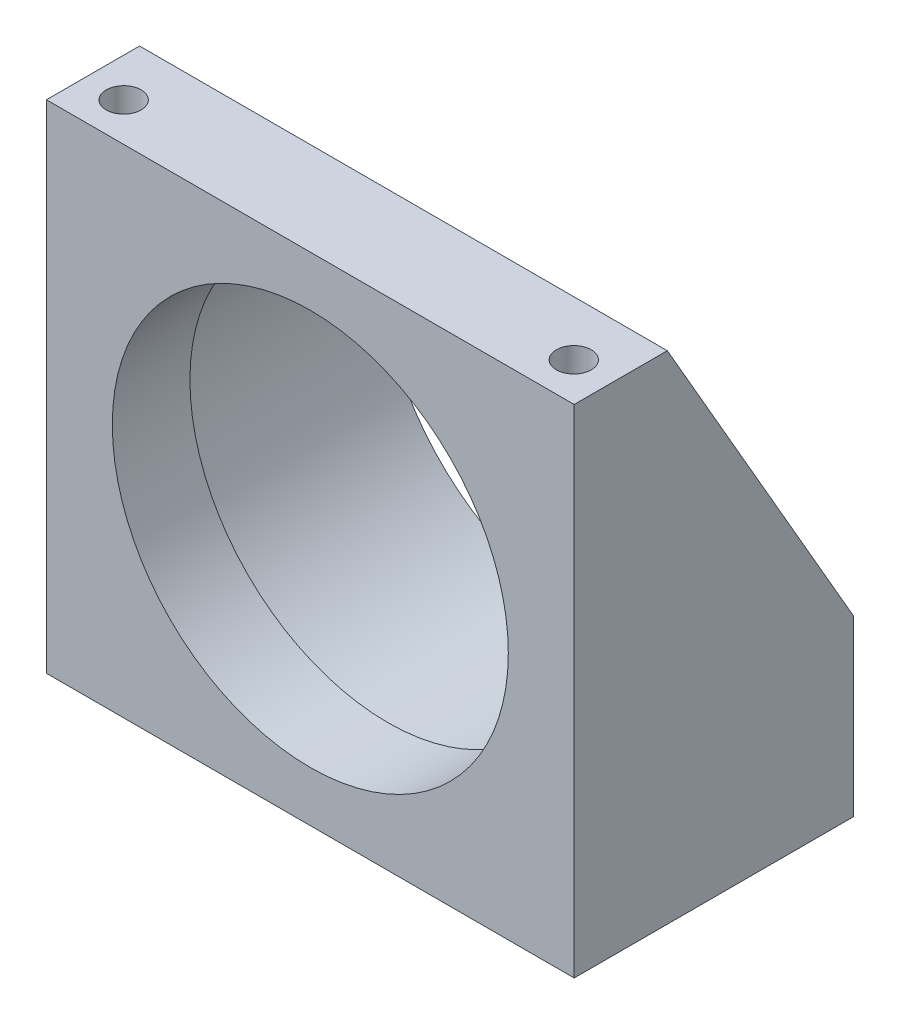
ISO-10303-21;
HEADER;
FILE_DESCRIPTION(('STEP AP214'),'2;1');
FILE_NAME('part.step','',(''),(''),'','','');
FILE_SCHEMA(('AUTOMOTIVE_DESIGN { 1 0 10303 214 1 1 1 1 }'));
ENDSEC;
DATA;
#1=APPLICATION_CONTEXT('core data for automotive mechanical design processes');
#2=APPLICATION_PROTOCOL_DEFINITION('international standard','automotive_design',2000,#1);
#3=PRODUCT_CONTEXT('',#1,'mechanical');
#4=PRODUCT('Part','Part','',(#3));
#5=PRODUCT_RELATED_PRODUCT_CATEGORY('part','',(#4));
#6=PRODUCT_DEFINITION_FORMATION('','',#4);
#7=PRODUCT_DEFINITION_CONTEXT('part definition',#1,'design');
#8=PRODUCT_DEFINITION('design','',#6,#7);
#9=PRODUCT_DEFINITION_SHAPE('','',#8);
#10=(LENGTH_UNIT() NAMED_UNIT(*) SI_UNIT(.MILLI.,.METRE.));
#11=(NAMED_UNIT(*) PLANE_ANGLE_UNIT() SI_UNIT($,.RADIAN.));
#12=(NAMED_UNIT(*) SI_UNIT($,.STERADIAN.) SOLID_ANGLE_UNIT());
#13=UNCERTAINTY_MEASURE_WITH_UNIT(LENGTH_MEASURE(1.E-05),#10,'distance_accuracy_value','');
#14=(GEOMETRIC_REPRESENTATION_CONTEXT(3) GLOBAL_UNCERTAINTY_ASSIGNED_CONTEXT((#13)) GLOBAL_UNIT_ASSIGNED_CONTEXT((#10,
#11,#12)) REPRESENTATION_CONTEXT('',''));
#15=CARTESIAN_POINT('',(0.,0.,0.));
#16=DIRECTION('',(0.,0.,1.));
#17=DIRECTION('',(1.,0.,0.));
#18=AXIS2_PLACEMENT_3D('',#15,#16,#17);
#19=CARTESIAN_POINT('',(-53.975,101.6,-57.15));
#20=DIRECTION('',(-1.,0.,0.));
#21=DIRECTION('',(0.,-1.,0.));
#22=AXIS2_PLACEMENT_3D('',#19,#20,#21);
#23=PLANE('',#22);
#24=DIRECTION('',(0.,-0.866185586048601,-0.499722453489577));
#25=VECTOR('',#24,1.);
#26=CARTESIAN_POINT('',(-53.975,101.6,-19.05));
#27=LINE('',#26,#25);
#28=CARTESIAN_POINT('',(-53.975,101.6,-19.05));
#29=VERTEX_POINT('',#28);
#30=CARTESIAN_POINT('',(-53.975,35.56,-57.15));
#31=VERTEX_POINT('',#30);
#32=EDGE_CURVE('E192',#29,#31,#27,.T.);
#33=ORIENTED_EDGE('',*,*,#32,.T.);
#34=DIRECTION('',(0.,-1.,0.));
#35=VECTOR('',#34,1.);
#36=CARTESIAN_POINT('',(-53.975,101.6,-57.15));
#37=LINE('',#36,#35);
#38=CARTESIAN_POINT('',(-53.975,0.,-57.15));
#39=VERTEX_POINT('',#38);
#40=EDGE_CURVE('E105',#31,#39,#37,.T.);
#41=ORIENTED_EDGE('',*,*,#40,.T.);
#42=DIRECTION('',(0.,0.,1.));
#43=VECTOR('',#42,1.);
#44=CARTESIAN_POINT('',(-53.975,0.,-57.15));
#45=LINE('',#44,#43);
#46=CARTESIAN_POINT('',(-53.975,0.,0.));
#47=VERTEX_POINT('',#46);
#48=EDGE_CURVE('E95',#39,#47,#45,.T.);
#49=ORIENTED_EDGE('',*,*,#48,.T.);
#50=DIRECTION('',(0.,-1.,0.));
#51=VECTOR('',#50,1.);
#52=CARTESIAN_POINT('',(-53.975,101.6,0.));
#53=LINE('',#52,#51);
#54=CARTESIAN_POINT('',(-53.975,101.6,0.));
#55=VERTEX_POINT('',#54);
#56=EDGE_CURVE('E93',#55,#47,#53,.T.);
#57=ORIENTED_EDGE('',*,*,#56,.F.);
#58=DIRECTION('',(0.,0.,1.));
#59=VECTOR('',#58,1.);
#60=CARTESIAN_POINT('',(-53.975,101.6,-57.15));
#61=LINE('',#60,#59);
#62=EDGE_CURVE('E78',#29,#55,#61,.T.);
#63=ORIENTED_EDGE('',*,*,#62,.F.);
#64=EDGE_LOOP('',(#33,#41,#49,#57,#63));
#65=FACE_BOUND('',#64,.T.);
#66=ADVANCED_FACE('F35',(#65),#23,.T.);
#67=CARTESIAN_POINT('',(-53.975,101.6,-57.15));
#68=DIRECTION('',(0.,1.,0.));
#69=DIRECTION('',(0.,0.,1.));
#70=AXIS2_PLACEMENT_3D('',#67,#68,#69);
#71=PLANE('',#70);
#72=CARTESIAN_POINT('',(-46.0502,101.6,-7.874));
#73=DIRECTION('',(0.,1.,0.));
#74=DIRECTION('',(0.,0.,1.));
#75=AXIS2_PLACEMENT_3D('',#72,#73,#74);
#76=CIRCLE('',#75,3.56870000000001);
#77=CARTESIAN_POINT('',(-46.0502,101.6,-4.30529999999998));
#78=VERTEX_POINT('',#77);
#79=EDGE_CURVE('E178',#78,#78,#76,.T.);
#80=ORIENTED_EDGE('',*,*,#79,.F.);
#81=EDGE_LOOP('',(#80));
#82=FACE_BOUND('',#81,.T.);
#83=CARTESIAN_POINT('',(46.0248,101.6,-7.874));
#84=DIRECTION('',(0.,1.,0.));
#85=DIRECTION('',(0.,0.,1.));
#86=AXIS2_PLACEMENT_3D('',#83,#84,#85);
#87=CIRCLE('',#86,3.56870000000001);
#88=CARTESIAN_POINT('',(46.0248,101.6,-4.30529999999998));
#89=VERTEX_POINT('',#88);
#90=EDGE_CURVE('E182',#89,#89,#87,.T.);
#91=ORIENTED_EDGE('',*,*,#90,.F.);
#92=EDGE_LOOP('',(#91));
#93=FACE_BOUND('',#92,.T.);
#94=DIRECTION('',(1.,0.,0.));
#95=VECTOR('',#94,1.);
#96=CARTESIAN_POINT('',(-53.975,101.6,-19.05));
#97=LINE('',#96,#95);
#98=CARTESIAN_POINT('',(53.975,101.6,-19.05));
#99=VERTEX_POINT('',#98);
#100=EDGE_CURVE('E86',#29,#99,#97,.T.);
#101=ORIENTED_EDGE('',*,*,#100,.F.);
#102=ORIENTED_EDGE('',*,*,#62,.T.);
#103=DIRECTION('',(-1.,0.,0.));
#104=VECTOR('',#103,1.);
#105=CARTESIAN_POINT('',(-53.975,101.6,0.));
#106=LINE('',#105,#104);
#107=CARTESIAN_POINT('',(53.975,101.6,0.));
#108=VERTEX_POINT('',#107);
#109=EDGE_CURVE('E83',#108,#55,#106,.T.);
#110=ORIENTED_EDGE('',*,*,#109,.F.);
#111=DIRECTION('',(0.,0.,1.));
#112=VECTOR('',#111,1.);
#113=CARTESIAN_POINT('',(53.975,101.6,-57.15));
#114=LINE('',#113,#112);
#115=EDGE_CURVE('E90',#99,#108,#114,.T.);
#116=ORIENTED_EDGE('',*,*,#115,.F.);
#117=EDGE_LOOP('',(#101,#102,#110,#116));
#118=FACE_BOUND('',#117,.T.);
#119=ADVANCED_FACE('F80',(#82,#93,#118),#71,.T.);
#120=CARTESIAN_POINT('',(53.975,101.6,-57.15));
#121=DIRECTION('',(1.,0.,0.));
#122=DIRECTION('',(0.,1.,0.));
#123=AXIS2_PLACEMENT_3D('',#120,#121,#122);
#124=PLANE('',#123);
#125=DIRECTION('',(0.,-0.866185586048601,-0.499722453489577));
#126=VECTOR('',#125,1.);
#127=CARTESIAN_POINT('',(53.975,101.6,-19.05));
#128=LINE('',#127,#126);
#129=CARTESIAN_POINT('',(53.975,35.56,-57.15));
#130=VERTEX_POINT('',#129);
#131=EDGE_CURVE('E119',#99,#130,#128,.T.);
#132=ORIENTED_EDGE('',*,*,#131,.F.);
#133=ORIENTED_EDGE('',*,*,#115,.T.);
#134=DIRECTION('',(0.,1.,0.));
#135=VECTOR('',#134,1.);
#136=CARTESIAN_POINT('',(53.975,101.6,0.));
#137=LINE('',#136,#135);
#138=CARTESIAN_POINT('',(53.975,0.,0.));
#139=VERTEX_POINT('',#138);
#140=EDGE_CURVE('E104',#139,#108,#137,.T.);
#141=ORIENTED_EDGE('',*,*,#140,.F.);
#142=DIRECTION('',(0.,0.,1.));
#143=VECTOR('',#142,1.);
#144=CARTESIAN_POINT('',(53.975,0.,-57.15));
#145=LINE('',#144,#143);
#146=CARTESIAN_POINT('',(53.975,0.,-57.15));
#147=VERTEX_POINT('',#146);
#148=EDGE_CURVE('E58',#147,#139,#145,.T.);
#149=ORIENTED_EDGE('',*,*,#148,.F.);
#150=DIRECTION('',(0.,1.,0.));
#151=VECTOR('',#150,1.);
#152=CARTESIAN_POINT('',(53.975,101.6,-57.15));
#153=LINE('',#152,#151);
#154=EDGE_CURVE('E115',#147,#130,#153,.T.);
#155=ORIENTED_EDGE('',*,*,#154,.T.);
#156=EDGE_LOOP('',(#132,#133,#141,#149,#155));
#157=FACE_BOUND('',#156,.T.);
#158=ADVANCED_FACE('F144',(#157),#124,.T.);
#159=CARTESIAN_POINT('',(-53.975,0.,-57.15));
#160=DIRECTION('',(0.,-1.,0.));
#161=DIRECTION('',(0.,0.,-1.));
#162=AXIS2_PLACEMENT_3D('',#159,#160,#161);
#163=PLANE('',#162);
#164=CARTESIAN_POINT('',(-46.0502,0.,-7.874));
#165=DIRECTION('',(0.,-1.,0.));
#166=DIRECTION('',(0.,0.,-1.));
#167=AXIS2_PLACEMENT_3D('',#164,#165,#166);
#168=CIRCLE('',#167,3.56870000000001);
#169=CARTESIAN_POINT('',(-46.0502,0.,-11.4427));
#170=VERTEX_POINT('',#169);
#171=EDGE_CURVE('E181',#170,#170,#168,.T.);
#172=ORIENTED_EDGE('',*,*,#171,.F.);
#173=EDGE_LOOP('',(#172));
#174=FACE_BOUND('',#173,.T.);
#175=CARTESIAN_POINT('',(46.0248,0.,-7.874));
#176=DIRECTION('',(0.,-1.,0.));
#177=DIRECTION('',(0.,0.,-1.));
#178=AXIS2_PLACEMENT_3D('',#175,#176,#177);
#179=CIRCLE('',#178,3.56870000000001);
#180=CARTESIAN_POINT('',(46.0248,0.,-11.4427));
#181=VERTEX_POINT('',#180);
#182=EDGE_CURVE('E185',#181,#181,#179,.T.);
#183=ORIENTED_EDGE('',*,*,#182,.F.);
#184=EDGE_LOOP('',(#183));
#185=FACE_BOUND('',#184,.T.);
#186=DIRECTION('',(1.,0.,0.));
#187=VECTOR('',#186,1.);
#188=CARTESIAN_POINT('',(-53.975,0.,0.));
#189=LINE('',#188,#187);
#190=EDGE_CURVE('E99',#47,#139,#189,.T.);
#191=ORIENTED_EDGE('',*,*,#190,.F.);
#192=ORIENTED_EDGE('',*,*,#48,.F.);
#193=DIRECTION('',(1.,0.,0.));
#194=VECTOR('',#193,1.);
#195=CARTESIAN_POINT('',(-53.975,0.,-57.15));
#196=LINE('',#195,#194);
#197=EDGE_CURVE('E107',#39,#147,#196,.T.);
#198=ORIENTED_EDGE('',*,*,#197,.T.);
#199=ORIENTED_EDGE('',*,*,#148,.T.);
#200=EDGE_LOOP('',(#191,#192,#198,#199));
#201=FACE_BOUND('',#200,.T.);
#202=ADVANCED_FACE('F148',(#174,#185,#201),#163,.T.);
#203=CARTESIAN_POINT('',(-53.975,0.,-57.15));
#204=DIRECTION('',(0.,0.,1.));
#205=DIRECTION('',(1.,0.,0.));
#206=AXIS2_PLACEMENT_3D('',#203,#204,#205);
#207=PLANE('',#206);
#208=DIRECTION('',(1.,0.,0.));
#209=VECTOR('',#208,1.);
#210=CARTESIAN_POINT('',(-53.975,35.56,-57.15));
#211=LINE('',#210,#209);
#212=CARTESIAN_POINT('',(-40.1295885351445,35.56,-57.15));
#213=VERTEX_POINT('',#212);
#214=EDGE_CURVE('E196',#31,#213,#211,.T.);
#215=ORIENTED_EDGE('',*,*,#214,.T.);
#216=CARTESIAN_POINT('',(0.,50.8,-57.15));
#217=DIRECTION('',(0.,0.,-1.));
#218=DIRECTION('',(-1.,0.,0.));
#219=AXIS2_PLACEMENT_3D('',#216,#217,#218);
#220=CIRCLE('',#219,42.926);
#221=CARTESIAN_POINT('',(40.1295885351445,35.56,-57.15));
#222=VERTEX_POINT('',#221);
#223=EDGE_CURVE('E49',#222,#213,#220,.T.);
#224=ORIENTED_EDGE('',*,*,#223,.F.);
#225=EDGE_CURVE('E199',#222,#130,#211,.T.);
#226=ORIENTED_EDGE('',*,*,#225,.T.);
#227=ORIENTED_EDGE('',*,*,#154,.F.);
#228=ORIENTED_EDGE('',*,*,#197,.F.);
#229=ORIENTED_EDGE('',*,*,#40,.F.);
#230=EDGE_LOOP('',(#215,#224,#226,#227,#228,#229));
#231=FACE_BOUND('',#230,.T.);
#232=ADVANCED_FACE('F151',(#231),#207,.F.);
#233=CARTESIAN_POINT('',(-53.975,0.,0.));
#234=DIRECTION('',(0.,0.,1.));
#235=DIRECTION('',(1.,0.,0.));
#236=AXIS2_PLACEMENT_3D('',#233,#234,#235);
#237=PLANE('',#236);
#238=CARTESIAN_POINT('',(0.,50.8,0.));
#239=DIRECTION('',(0.,0.,1.));
#240=DIRECTION('',(1.,0.,0.));
#241=AXIS2_PLACEMENT_3D('',#238,#239,#240);
#242=CIRCLE('',#241,40.5003);
#243=CARTESIAN_POINT('',(40.5003,50.8,0.));
#244=VERTEX_POINT('',#243);
#245=EDGE_CURVE('E100',#244,#244,#242,.T.);
#246=ORIENTED_EDGE('',*,*,#245,.F.);
#247=EDGE_LOOP('',(#246));
#248=FACE_BOUND('',#247,.T.);
#249=ORIENTED_EDGE('',*,*,#56,.T.);
#250=ORIENTED_EDGE('',*,*,#190,.T.);
#251=ORIENTED_EDGE('',*,*,#140,.T.);
#252=ORIENTED_EDGE('',*,*,#109,.T.);
#253=EDGE_LOOP('',(#249,#250,#251,#252));
#254=FACE_BOUND('',#253,.T.);
#255=ADVANCED_FACE('F103',(#248,#254),#237,.T.);
#256=CARTESIAN_POINT('',(0.,50.8,-57.15));
#257=DIRECTION('',(0.,0.,1.));
#258=DIRECTION('',(1.,0.,0.));
#259=AXIS2_PLACEMENT_3D('',#256,#257,#258);
#260=CYLINDRICAL_SURFACE('',#259,40.5003);
#261=CARTESIAN_POINT('',(0.,50.8,-15.875));
#262=DIRECTION('',(0.,0.,1.));
#263=DIRECTION('',(1.,0.,0.));
#264=AXIS2_PLACEMENT_3D('',#261,#262,#263);
#265=CIRCLE('',#264,40.5003);
#266=CARTESIAN_POINT('',(40.5003,50.8,-15.875));
#267=VERTEX_POINT('',#266);
#268=EDGE_CURVE('E117',#267,#267,#265,.F.);
#269=ORIENTED_EDGE('',*,*,#268,.T.);
#270=EDGE_LOOP('',(#269));
#271=FACE_BOUND('',#270,.T.);
#272=ORIENTED_EDGE('',*,*,#245,.T.);
#273=EDGE_LOOP('',(#272));
#274=FACE_BOUND('',#273,.T.);
#275=ADVANCED_FACE('F157',(#271,#274),#260,.F.);
#276=CARTESIAN_POINT('',(-53.975,101.6,-19.05));
#277=DIRECTION('',(0.,-0.499722453489577,0.866185586048601));
#278=DIRECTION('',(0.,-0.866185586048601,-0.499722453489577));
#279=AXIS2_PLACEMENT_3D('',#276,#277,#278);
#280=PLANE('',#279);
#281=ORIENTED_EDGE('',*,*,#225,.F.);
#282=CARTESIAN_POINT('',(0.,50.8,-48.3576923076923));
#283=DIRECTION('',(0.,-0.499722453489577,0.866185586048601));
#284=DIRECTION('',(0.,-0.866185586048601,-0.499722453489577));
#285=AXIS2_PLACEMENT_3D('',#282,#283,#284);
#286=ELLIPSE('',#285,49.5575090273916,42.926);
#287=EDGE_CURVE('E89',#222,#213,#286,.T.);
#288=ORIENTED_EDGE('',*,*,#287,.T.);
#289=ORIENTED_EDGE('',*,*,#214,.F.);
#290=ORIENTED_EDGE('',*,*,#32,.F.);
#291=ORIENTED_EDGE('',*,*,#100,.T.);
#292=ORIENTED_EDGE('',*,*,#131,.T.);
#293=EDGE_LOOP('',(#281,#288,#289,#290,#291,#292));
#294=FACE_BOUND('',#293,.T.);
#295=ADVANCED_FACE('F164',(#294),#280,.F.);
#296=CARTESIAN_POINT('',(-53.975,0.,-15.875));
#297=DIRECTION('',(0.,0.,1.));
#298=DIRECTION('',(1.,0.,0.));
#299=AXIS2_PLACEMENT_3D('',#296,#297,#298);
#300=PLANE('',#299);
#301=CARTESIAN_POINT('',(0.,50.8,-15.875));
#302=DIRECTION('',(0.,0.,1.));
#303=DIRECTION('',(1.,0.,0.));
#304=AXIS2_PLACEMENT_3D('',#301,#302,#303);
#305=CIRCLE('',#304,41.402);
#306=CARTESIAN_POINT('',(41.402,50.8,-15.875));
#307=VERTEX_POINT('',#306);
#308=EDGE_CURVE('E43',#307,#307,#305,.F.);
#309=ORIENTED_EDGE('',*,*,#308,.T.);
#310=EDGE_LOOP('',(#309));
#311=FACE_BOUND('',#310,.T.);
#312=ORIENTED_EDGE('',*,*,#268,.F.);
#313=EDGE_LOOP('',(#312));
#314=FACE_BOUND('',#313,.T.);
#315=ADVANCED_FACE('F123',(#311,#314),#300,.F.);
#316=CARTESIAN_POINT('',(0.,50.8,121.413062756855));
#317=DIRECTION('',(0.,0.,-1.));
#318=DIRECTION('',(-1.,0.,0.));
#319=AXIS2_PLACEMENT_3D('',#316,#317,#318);
#320=CYLINDRICAL_SURFACE('',#319,42.926);
#321=CARTESIAN_POINT('',(0.,50.8,-17.399));
#322=DIRECTION('',(0.,0.,1.));
#323=DIRECTION('',(1.,0.,0.));
#324=AXIS2_PLACEMENT_3D('',#321,#322,#323);
#325=CIRCLE('',#324,42.926);
#326=CARTESIAN_POINT('',(42.926,50.8,-17.399));
#327=VERTEX_POINT('',#326);
#328=EDGE_CURVE('E12',#327,#327,#325,.T.);
#329=ORIENTED_EDGE('',*,*,#328,.T.);
#330=EDGE_LOOP('',(#329));
#331=FACE_BOUND('',#330,.T.);
#332=ORIENTED_EDGE('',*,*,#223,.T.);
#333=ORIENTED_EDGE('',*,*,#287,.F.);
#334=EDGE_LOOP('',(#332,#333));
#335=FACE_BOUND('',#334,.T.);
#336=ADVANCED_FACE('F128',(#331,#335),#320,.F.);
#337=CARTESIAN_POINT('',(0.,50.8,-17.399));
#338=DIRECTION('',(0.,0.,1.));
#339=DIRECTION('',(1.,0.,0.));
#340=AXIS2_PLACEMENT_3D('',#337,#338,#339);
#341=TOROIDAL_SURFACE('',#340,41.402,1.524);
#342=ORIENTED_EDGE('',*,*,#328,.F.);
#343=EDGE_LOOP('',(#342));
#344=FACE_BOUND('',#343,.T.);
#345=ORIENTED_EDGE('',*,*,#308,.F.);
#346=EDGE_LOOP('',(#345));
#347=FACE_BOUND('',#346,.T.);
#348=ADVANCED_FACE('F37',(#344,#347),#341,.F.);
#349=CARTESIAN_POINT('',(46.0248,101.6,-7.874));
#350=DIRECTION('',(0.,1.,0.));
#351=DIRECTION('',(0.,0.,1.));
#352=AXIS2_PLACEMENT_3D('',#349,#350,#351);
#353=CYLINDRICAL_SURFACE('',#352,3.56870000000001);
#354=ORIENTED_EDGE('',*,*,#90,.T.);
#355=EDGE_LOOP('',(#354));
#356=FACE_BOUND('',#355,.T.);
#357=ORIENTED_EDGE('',*,*,#182,.T.);
#358=EDGE_LOOP('',(#357));
#359=FACE_BOUND('',#358,.T.);
#360=ADVANCED_FACE('F127',(#356,#359),#353,.F.);
#361=CARTESIAN_POINT('',(-46.0502,101.6,-7.874));
#362=DIRECTION('',(0.,1.,0.));
#363=DIRECTION('',(0.,0.,1.));
#364=AXIS2_PLACEMENT_3D('',#361,#362,#363);
#365=CYLINDRICAL_SURFACE('',#364,3.56870000000001);
#366=ORIENTED_EDGE('',*,*,#79,.T.);
#367=EDGE_LOOP('',(#366));
#368=FACE_BOUND('',#367,.T.);
#369=ORIENTED_EDGE('',*,*,#171,.T.);
#370=EDGE_LOOP('',(#369));
#371=FACE_BOUND('',#370,.T.);
#372=ADVANCED_FACE('F134',(#368,#371),#365,.F.);
#373=CLOSED_SHELL('',(#66,#119,#158,#202,#232,#255,#275,#295,#315,#336,#348,#360,#372));
#374=MANIFOLD_SOLID_BREP('B2',#373);
#375=ADVANCED_BREP_SHAPE_REPRESENTATION('',(#18,#374),#14);
#376=SHAPE_DEFINITION_REPRESENTATION(#9,#375);
ENDSEC;
END-ISO-10303-21;
